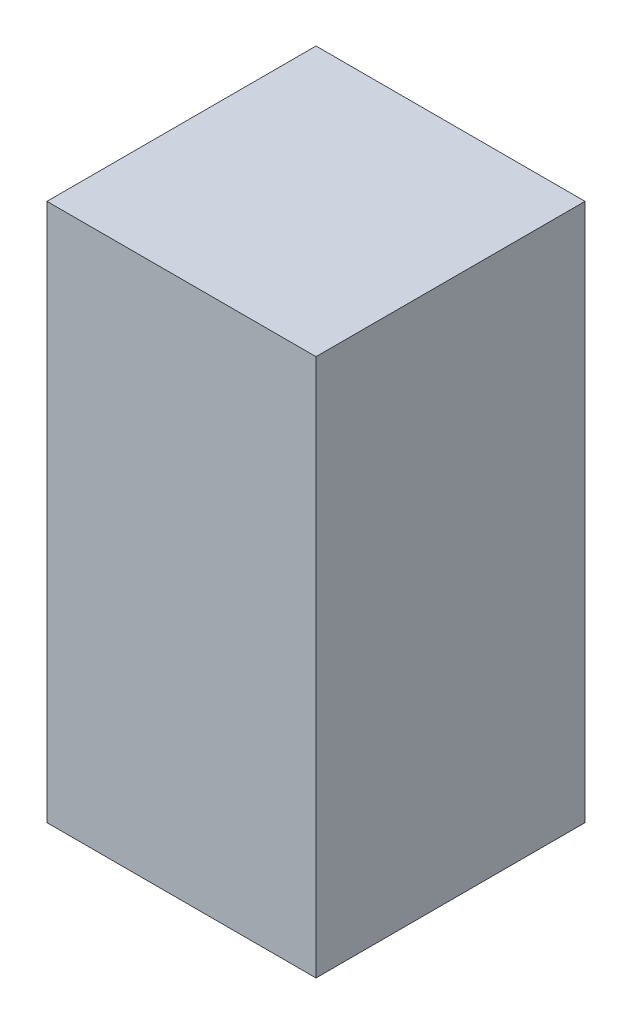
ISO-10303-21;
HEADER;
FILE_DESCRIPTION(('STEP AP214'),'2;1');
FILE_NAME('part.step','',(''),(''),'','','');
FILE_SCHEMA(('AUTOMOTIVE_DESIGN { 1 0 10303 214 1 1 1 1 }'));
ENDSEC;
DATA;
#1=APPLICATION_CONTEXT('core data for automotive mechanical design processes');
#2=APPLICATION_PROTOCOL_DEFINITION('international standard','automotive_design',2000,#1);
#3=PRODUCT_CONTEXT('',#1,'mechanical');
#4=PRODUCT('Part','Part','',(#3));
#5=PRODUCT_RELATED_PRODUCT_CATEGORY('part','',(#4));
#6=PRODUCT_DEFINITION_FORMATION('','',#4);
#7=PRODUCT_DEFINITION_CONTEXT('part definition',#1,'design');
#8=PRODUCT_DEFINITION('design','',#6,#7);
#9=PRODUCT_DEFINITION_SHAPE('','',#8);
#10=(LENGTH_UNIT() NAMED_UNIT(*) SI_UNIT(.MILLI.,.METRE.));
#11=(NAMED_UNIT(*) PLANE_ANGLE_UNIT() SI_UNIT($,.RADIAN.));
#12=(NAMED_UNIT(*) SI_UNIT($,.STERADIAN.) SOLID_ANGLE_UNIT());
#13=UNCERTAINTY_MEASURE_WITH_UNIT(LENGTH_MEASURE(1.E-05),#10,'distance_accuracy_value','');
#14=(GEOMETRIC_REPRESENTATION_CONTEXT(3) GLOBAL_UNCERTAINTY_ASSIGNED_CONTEXT((#13)) GLOBAL_UNIT_ASSIGNED_CONTEXT((#10,
#11,#12)) REPRESENTATION_CONTEXT('',''));
#15=CARTESIAN_POINT('',(0.,0.,0.));
#16=DIRECTION('',(0.,0.,1.));
#17=DIRECTION('',(1.,0.,0.));
#18=AXIS2_PLACEMENT_3D('',#15,#16,#17);
#19=CARTESIAN_POINT('',(7.5,-15.,15.));
#20=DIRECTION('',(-1.,0.,0.));
#21=DIRECTION('',(0.,0.,1.));
#22=AXIS2_PLACEMENT_3D('',#19,#20,#21);
#23=PLANE('',#22);
#24=DIRECTION('',(0.,1.,0.));
#25=VECTOR('',#24,1.);
#26=CARTESIAN_POINT('',(7.5,-15.,0.));
#27=LINE('',#26,#25);
#28=CARTESIAN_POINT('',(7.5,-15.,0.));
#29=VERTEX_POINT('',#28);
#30=CARTESIAN_POINT('',(7.5,15.,0.));
#31=VERTEX_POINT('',#30);
#32=EDGE_CURVE('E96',#29,#31,#27,.T.);
#33=ORIENTED_EDGE('',*,*,#32,.T.);
#34=DIRECTION('',(0.,0.,-1.));
#35=VECTOR('',#34,1.);
#36=CARTESIAN_POINT('',(7.5,15.,15.));
#37=LINE('',#36,#35);
#38=CARTESIAN_POINT('',(7.5,15.,15.));
#39=VERTEX_POINT('',#38);
#40=EDGE_CURVE('E11',#39,#31,#37,.T.);
#41=ORIENTED_EDGE('',*,*,#40,.F.);
#42=DIRECTION('',(0.,1.,0.));
#43=VECTOR('',#42,1.);
#44=CARTESIAN_POINT('',(7.5,-15.,15.));
#45=LINE('',#44,#43);
#46=CARTESIAN_POINT('',(7.5,-15.,15.));
#47=VERTEX_POINT('',#46);
#48=EDGE_CURVE('E84',#47,#39,#45,.T.);
#49=ORIENTED_EDGE('',*,*,#48,.F.);
#50=DIRECTION('',(0.,0.,-1.));
#51=VECTOR('',#50,1.);
#52=CARTESIAN_POINT('',(7.5,-15.,15.));
#53=LINE('',#52,#51);
#54=EDGE_CURVE('E92',#47,#29,#53,.T.);
#55=ORIENTED_EDGE('',*,*,#54,.T.);
#56=EDGE_LOOP('',(#33,#41,#49,#55));
#57=FACE_BOUND('',#56,.T.);
#58=ADVANCED_FACE('F33',(#57),#23,.F.);
#59=CARTESIAN_POINT('',(-7.5,15.,15.));
#60=DIRECTION('',(0.,-1.,0.));
#61=DIRECTION('',(0.,0.,-1.));
#62=AXIS2_PLACEMENT_3D('',#59,#60,#61);
#63=PLANE('',#62);
#64=DIRECTION('',(-1.,0.,0.));
#65=VECTOR('',#64,1.);
#66=CARTESIAN_POINT('',(-7.5,15.,0.));
#67=LINE('',#66,#65);
#68=CARTESIAN_POINT('',(-7.5,15.,0.));
#69=VERTEX_POINT('',#68);
#70=EDGE_CURVE('E88',#31,#69,#67,.T.);
#71=ORIENTED_EDGE('',*,*,#70,.T.);
#72=DIRECTION('',(0.,0.,-1.));
#73=VECTOR('',#72,1.);
#74=CARTESIAN_POINT('',(-7.5,15.,15.));
#75=LINE('',#74,#73);
#76=CARTESIAN_POINT('',(-7.5,15.,15.));
#77=VERTEX_POINT('',#76);
#78=EDGE_CURVE('E41',#77,#69,#75,.T.);
#79=ORIENTED_EDGE('',*,*,#78,.F.);
#80=DIRECTION('',(-1.,0.,0.));
#81=VECTOR('',#80,1.);
#82=CARTESIAN_POINT('',(-7.5,15.,15.));
#83=LINE('',#82,#81);
#84=EDGE_CURVE('E79',#39,#77,#83,.T.);
#85=ORIENTED_EDGE('',*,*,#84,.F.);
#86=ORIENTED_EDGE('',*,*,#40,.T.);
#87=EDGE_LOOP('',(#71,#79,#85,#86));
#88=FACE_BOUND('',#87,.T.);
#89=ADVANCED_FACE('F87',(#88),#63,.F.);
#90=CARTESIAN_POINT('',(-7.5,-15.,15.));
#91=DIRECTION('',(1.,0.,0.));
#92=DIRECTION('',(0.,0.,-1.));
#93=AXIS2_PLACEMENT_3D('',#90,#91,#92);
#94=PLANE('',#93);
#95=DIRECTION('',(0.,-1.,0.));
#96=VECTOR('',#95,1.);
#97=CARTESIAN_POINT('',(-7.5,-15.,0.));
#98=LINE('',#97,#96);
#99=CARTESIAN_POINT('',(-7.5,-15.,0.));
#100=VERTEX_POINT('',#99);
#101=EDGE_CURVE('E66',#69,#100,#98,.T.);
#102=ORIENTED_EDGE('',*,*,#101,.T.);
#103=DIRECTION('',(0.,0.,-1.));
#104=VECTOR('',#103,1.);
#105=CARTESIAN_POINT('',(-7.5,-15.,15.));
#106=LINE('',#105,#104);
#107=CARTESIAN_POINT('',(-7.5,-15.,15.));
#108=VERTEX_POINT('',#107);
#109=EDGE_CURVE('E89',#108,#100,#106,.T.);
#110=ORIENTED_EDGE('',*,*,#109,.F.);
#111=DIRECTION('',(0.,-1.,0.));
#112=VECTOR('',#111,1.);
#113=CARTESIAN_POINT('',(-7.5,-15.,15.));
#114=LINE('',#113,#112);
#115=EDGE_CURVE('E82',#77,#108,#114,.T.);
#116=ORIENTED_EDGE('',*,*,#115,.F.);
#117=ORIENTED_EDGE('',*,*,#78,.T.);
#118=EDGE_LOOP('',(#102,#110,#116,#117));
#119=FACE_BOUND('',#118,.T.);
#120=ADVANCED_FACE('F90',(#119),#94,.F.);
#121=CARTESIAN_POINT('',(-7.5,-15.,15.));
#122=DIRECTION('',(0.,1.,0.));
#123=DIRECTION('',(0.,0.,1.));
#124=AXIS2_PLACEMENT_3D('',#121,#122,#123);
#125=PLANE('',#124);
#126=DIRECTION('',(1.,0.,0.));
#127=VECTOR('',#126,1.);
#128=CARTESIAN_POINT('',(-7.5,-15.,0.));
#129=LINE('',#128,#127);
#130=EDGE_CURVE('E72',#100,#29,#129,.T.);
#131=ORIENTED_EDGE('',*,*,#130,.T.);
#132=ORIENTED_EDGE('',*,*,#54,.F.);
#133=DIRECTION('',(1.,0.,0.));
#134=VECTOR('',#133,1.);
#135=CARTESIAN_POINT('',(-7.5,-15.,15.));
#136=LINE('',#135,#134);
#137=EDGE_CURVE('E49',#108,#47,#136,.T.);
#138=ORIENTED_EDGE('',*,*,#137,.F.);
#139=ORIENTED_EDGE('',*,*,#109,.T.);
#140=EDGE_LOOP('',(#131,#132,#138,#139));
#141=FACE_BOUND('',#140,.T.);
#142=ADVANCED_FACE('F103',(#141),#125,.F.);
#143=CARTESIAN_POINT('',(0.,0.,15.));
#144=DIRECTION('',(0.,0.,-1.));
#145=DIRECTION('',(-1.,0.,0.));
#146=AXIS2_PLACEMENT_3D('',#143,#144,#145);
#147=PLANE('',#146);
#148=ORIENTED_EDGE('',*,*,#48,.T.);
#149=ORIENTED_EDGE('',*,*,#84,.T.);
#150=ORIENTED_EDGE('',*,*,#115,.T.);
#151=ORIENTED_EDGE('',*,*,#137,.T.);
#152=EDGE_LOOP('',(#148,#149,#150,#151));
#153=FACE_BOUND('',#152,.T.);
#154=ADVANCED_FACE('F80',(#153),#147,.F.);
#155=CARTESIAN_POINT('',(0.,0.,0.));
#156=DIRECTION('',(0.,0.,-1.));
#157=DIRECTION('',(-1.,0.,0.));
#158=AXIS2_PLACEMENT_3D('',#155,#156,#157);
#159=PLANE('',#158);
#160=ORIENTED_EDGE('',*,*,#32,.F.);
#161=ORIENTED_EDGE('',*,*,#130,.F.);
#162=ORIENTED_EDGE('',*,*,#101,.F.);
#163=ORIENTED_EDGE('',*,*,#70,.F.);
#164=EDGE_LOOP('',(#160,#161,#162,#163));
#165=FACE_BOUND('',#164,.T.);
#166=ADVANCED_FACE('F106',(#165),#159,.T.);
#167=CLOSED_SHELL('',(#58,#89,#120,#142,#154,#166));
#168=MANIFOLD_SOLID_BREP('B2',#167);
#169=ADVANCED_BREP_SHAPE_REPRESENTATION('',(#18,#168),#14);
#170=SHAPE_DEFINITION_REPRESENTATION(#9,#169);
ENDSEC;
END-ISO-10303-21;
